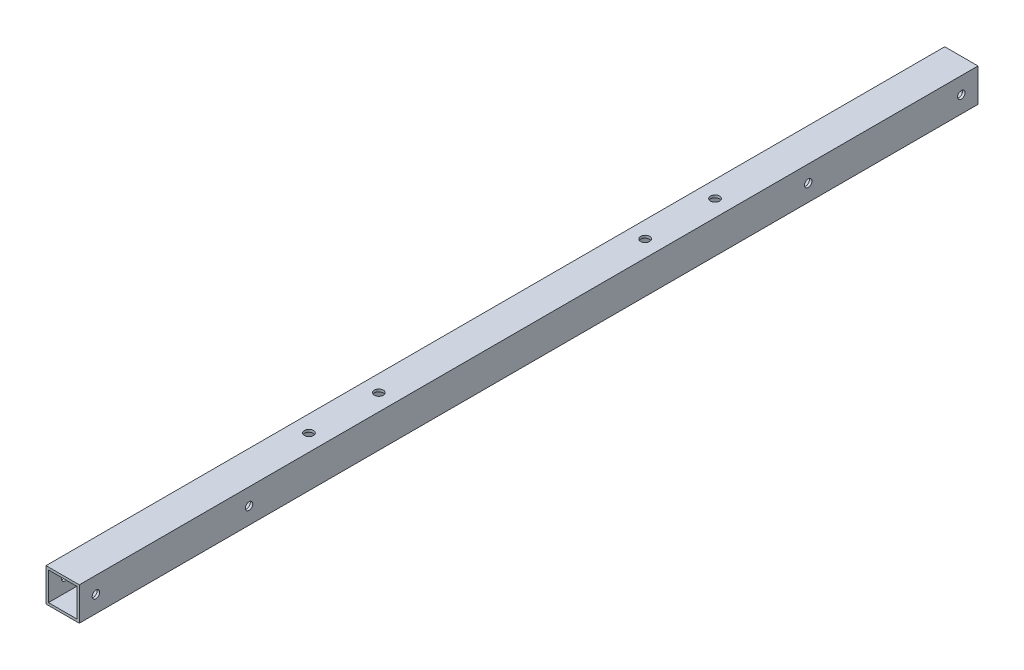
ISO-10303-21;
HEADER;
FILE_DESCRIPTION(('STEP AP214'),'2;1');
FILE_NAME('part.step','',(''),(''),'','','');
FILE_SCHEMA(('AUTOMOTIVE_DESIGN { 1 0 10303 214 1 1 1 1 }'));
ENDSEC;
DATA;
#1=APPLICATION_CONTEXT('core data for automotive mechanical design processes');
#2=APPLICATION_PROTOCOL_DEFINITION('international standard','automotive_design',2000,#1);
#3=PRODUCT_CONTEXT('',#1,'mechanical');
#4=PRODUCT('Part','Part','',(#3));
#5=PRODUCT_RELATED_PRODUCT_CATEGORY('part','',(#4));
#6=PRODUCT_DEFINITION_FORMATION('','',#4);
#7=PRODUCT_DEFINITION_CONTEXT('part definition',#1,'design');
#8=PRODUCT_DEFINITION('design','',#6,#7);
#9=PRODUCT_DEFINITION_SHAPE('','',#8);
#10=(LENGTH_UNIT() NAMED_UNIT(*) SI_UNIT(.MILLI.,.METRE.));
#11=(NAMED_UNIT(*) PLANE_ANGLE_UNIT() SI_UNIT($,.RADIAN.));
#12=(NAMED_UNIT(*) SI_UNIT($,.STERADIAN.) SOLID_ANGLE_UNIT());
#13=UNCERTAINTY_MEASURE_WITH_UNIT(LENGTH_MEASURE(1.E-05),#10,'distance_accuracy_value','');
#14=(GEOMETRIC_REPRESENTATION_CONTEXT(3) GLOBAL_UNCERTAINTY_ASSIGNED_CONTEXT((#13)) GLOBAL_UNIT_ASSIGNED_CONTEXT((#10,
#11,#12)) REPRESENTATION_CONTEXT('',''));
#15=CARTESIAN_POINT('',(0.,0.,0.));
#16=DIRECTION('',(0.,0.,1.));
#17=DIRECTION('',(1.,0.,0.));
#18=AXIS2_PLACEMENT_3D('',#15,#16,#17);
#19=CARTESIAN_POINT('',(-10.,-10.,540.));
#20=DIRECTION('',(0.,1.,0.));
#21=DIRECTION('',(0.,0.,1.));
#22=AXIS2_PLACEMENT_3D('',#19,#20,#21);
#23=PLANE('',#22);
#24=CARTESIAN_POINT('',(0.,-10.,148.));
#25=DIRECTION('',(0.,-1.,0.));
#26=DIRECTION('',(0.,0.,-1.));
#27=AXIS2_PLACEMENT_3D('',#24,#25,#26);
#28=CIRCLE('',#27,4.99999999999999);
#29=CARTESIAN_POINT('',(0.,-10.,143.));
#30=VERTEX_POINT('',#29);
#31=EDGE_CURVE('E629',#30,#30,#28,.T.);
#32=ORIENTED_EDGE('',*,*,#31,.F.);
#33=EDGE_LOOP('',(#32));
#34=FACE_BOUND('',#33,.T.);
#35=CARTESIAN_POINT('',(0.,-10.,190.));
#36=DIRECTION('',(0.,-1.,0.));
#37=DIRECTION('',(0.,0.,-1.));
#38=AXIS2_PLACEMENT_3D('',#35,#36,#37);
#39=CIRCLE('',#38,4.99999999999999);
#40=CARTESIAN_POINT('',(0.,-10.,185.));
#41=VERTEX_POINT('',#40);
#42=EDGE_CURVE('E634',#41,#41,#39,.T.);
#43=ORIENTED_EDGE('',*,*,#42,.F.);
#44=EDGE_LOOP('',(#43));
#45=FACE_BOUND('',#44,.T.);
#46=DIRECTION('',(1.,0.,0.));
#47=VECTOR('',#46,1.);
#48=CARTESIAN_POINT('',(-10.,-10.,0.));
#49=LINE('',#48,#47);
#50=CARTESIAN_POINT('',(-10.,-10.,0.));
#51=VERTEX_POINT('',#50);
#52=CARTESIAN_POINT('',(10.,-10.,0.));
#53=VERTEX_POINT('',#52);
#54=EDGE_CURVE('E167',#51,#53,#49,.T.);
#55=ORIENTED_EDGE('',*,*,#54,.T.);
#56=DIRECTION('',(0.,0.,-1.));
#57=VECTOR('',#56,1.);
#58=CARTESIAN_POINT('',(10.,-10.,540.));
#59=LINE('',#58,#57);
#60=CARTESIAN_POINT('',(10.,-10.,540.));
#61=VERTEX_POINT('',#60);
#62=EDGE_CURVE('E176',#61,#53,#59,.T.);
#63=ORIENTED_EDGE('',*,*,#62,.F.);
#64=DIRECTION('',(1.,0.,0.));
#65=VECTOR('',#64,1.);
#66=CARTESIAN_POINT('',(-10.,-10.,540.));
#67=LINE('',#66,#65);
#68=CARTESIAN_POINT('',(-10.,-10.,540.));
#69=VERTEX_POINT('',#68);
#70=EDGE_CURVE('E173',#69,#61,#67,.T.);
#71=ORIENTED_EDGE('',*,*,#70,.F.);
#72=DIRECTION('',(0.,0.,-1.));
#73=VECTOR('',#72,1.);
#74=CARTESIAN_POINT('',(-10.,-10.,540.));
#75=LINE('',#74,#73);
#76=EDGE_CURVE('E191',#69,#51,#75,.T.);
#77=ORIENTED_EDGE('',*,*,#76,.T.);
#78=EDGE_LOOP('',(#55,#63,#71,#77));
#79=FACE_BOUND('',#78,.T.);
#80=CARTESIAN_POINT('',(0.,-10.,392.));
#81=DIRECTION('',(0.,-1.,0.));
#82=DIRECTION('',(0.,0.,-1.));
#83=AXIS2_PLACEMENT_3D('',#80,#81,#82);
#84=CIRCLE('',#83,4.99999999999999);
#85=CARTESIAN_POINT('',(0.,-10.,387.));
#86=VERTEX_POINT('',#85);
#87=EDGE_CURVE('E263',#86,#86,#84,.T.);
#88=ORIENTED_EDGE('',*,*,#87,.F.);
#89=EDGE_LOOP('',(#88));
#90=FACE_BOUND('',#89,.T.);
#91=CARTESIAN_POINT('',(0.,-10.,350.));
#92=DIRECTION('',(0.,-1.,0.));
#93=DIRECTION('',(0.,0.,-1.));
#94=AXIS2_PLACEMENT_3D('',#91,#92,#93);
#95=CIRCLE('',#94,4.99999999999999);
#96=CARTESIAN_POINT('',(0.,-10.,345.));
#97=VERTEX_POINT('',#96);
#98=EDGE_CURVE('E644',#97,#97,#95,.T.);
#99=ORIENTED_EDGE('',*,*,#98,.F.);
#100=EDGE_LOOP('',(#99));
#101=FACE_BOUND('',#100,.T.);
#102=ADVANCED_FACE('F42',(#34,#45,#79,#90,#101),#23,.F.);
#103=CARTESIAN_POINT('',(-8.5,-8.5,540.));
#104=DIRECTION('',(0.,1.,0.));
#105=DIRECTION('',(0.,0.,1.));
#106=AXIS2_PLACEMENT_3D('',#103,#104,#105);
#107=PLANE('',#106);
#108=CARTESIAN_POINT('',(0.,-8.5,148.));
#109=DIRECTION('',(0.,-1.,0.));
#110=DIRECTION('',(0.,0.,-1.));
#111=AXIS2_PLACEMENT_3D('',#108,#109,#110);
#112=CIRCLE('',#111,4.99999999999999);
#113=CARTESIAN_POINT('',(0.,-8.5,143.));
#114=VERTEX_POINT('',#113);
#115=EDGE_CURVE('E627',#114,#114,#112,.T.);
#116=ORIENTED_EDGE('',*,*,#115,.T.);
#117=EDGE_LOOP('',(#116));
#118=FACE_BOUND('',#117,.T.);
#119=CARTESIAN_POINT('',(0.,-8.5,190.));
#120=DIRECTION('',(0.,-1.,0.));
#121=DIRECTION('',(0.,0.,-1.));
#122=AXIS2_PLACEMENT_3D('',#119,#120,#121);
#123=CIRCLE('',#122,4.99999999999999);
#124=CARTESIAN_POINT('',(0.,-8.5,185.));
#125=VERTEX_POINT('',#124);
#126=EDGE_CURVE('E640',#125,#125,#123,.T.);
#127=ORIENTED_EDGE('',*,*,#126,.T.);
#128=EDGE_LOOP('',(#127));
#129=FACE_BOUND('',#128,.T.);
#130=CARTESIAN_POINT('',(0.,-8.5,350.));
#131=DIRECTION('',(0.,-1.,0.));
#132=DIRECTION('',(0.,0.,-1.));
#133=AXIS2_PLACEMENT_3D('',#130,#131,#132);
#134=CIRCLE('',#133,4.99999999999999);
#135=CARTESIAN_POINT('',(0.,-8.5,345.));
#136=VERTEX_POINT('',#135);
#137=EDGE_CURVE('E272',#136,#136,#134,.T.);
#138=ORIENTED_EDGE('',*,*,#137,.T.);
#139=EDGE_LOOP('',(#138));
#140=FACE_BOUND('',#139,.T.);
#141=DIRECTION('',(1.,0.,0.));
#142=VECTOR('',#141,1.);
#143=CARTESIAN_POINT('',(-8.5,-8.5,0.));
#144=LINE('',#143,#142);
#145=CARTESIAN_POINT('',(-8.5,-8.5,0.));
#146=VERTEX_POINT('',#145);
#147=CARTESIAN_POINT('',(8.5,-8.5,0.));
#148=VERTEX_POINT('',#147);
#149=EDGE_CURVE('E120',#146,#148,#144,.T.);
#150=ORIENTED_EDGE('',*,*,#149,.F.);
#151=DIRECTION('',(0.,0.,-1.));
#152=VECTOR('',#151,1.);
#153=CARTESIAN_POINT('',(-8.5,-8.5,540.));
#154=LINE('',#153,#152);
#155=CARTESIAN_POINT('',(-8.5,-8.5,540.));
#156=VERTEX_POINT('',#155);
#157=EDGE_CURVE('E60',#156,#146,#154,.T.);
#158=ORIENTED_EDGE('',*,*,#157,.F.);
#159=DIRECTION('',(1.,0.,0.));
#160=VECTOR('',#159,1.);
#161=CARTESIAN_POINT('',(-8.5,-8.5,540.));
#162=LINE('',#161,#160);
#163=CARTESIAN_POINT('',(8.5,-8.5,540.));
#164=VERTEX_POINT('',#163);
#165=EDGE_CURVE('E138',#156,#164,#162,.T.);
#166=ORIENTED_EDGE('',*,*,#165,.T.);
#167=DIRECTION('',(0.,0.,-1.));
#168=VECTOR('',#167,1.);
#169=CARTESIAN_POINT('',(8.5,-8.5,540.));
#170=LINE('',#169,#168);
#171=EDGE_CURVE('E114',#164,#148,#170,.T.);
#172=ORIENTED_EDGE('',*,*,#171,.T.);
#173=EDGE_LOOP('',(#150,#158,#166,#172));
#174=FACE_BOUND('',#173,.T.);
#175=CARTESIAN_POINT('',(0.,-8.5,392.));
#176=DIRECTION('',(0.,-1.,0.));
#177=DIRECTION('',(0.,0.,-1.));
#178=AXIS2_PLACEMENT_3D('',#175,#176,#177);
#179=CIRCLE('',#178,4.99999999999999);
#180=CARTESIAN_POINT('',(0.,-8.5,387.));
#181=VERTEX_POINT('',#180);
#182=EDGE_CURVE('E259',#181,#181,#179,.T.);
#183=ORIENTED_EDGE('',*,*,#182,.T.);
#184=EDGE_LOOP('',(#183));
#185=FACE_BOUND('',#184,.T.);
#186=ADVANCED_FACE('F252',(#118,#129,#140,#174,#185),#107,.T.);
#187=CARTESIAN_POINT('',(0.,0.,540.));
#188=DIRECTION('',(0.,0.,-1.));
#189=DIRECTION('',(-1.,0.,0.));
#190=AXIS2_PLACEMENT_3D('',#187,#188,#189);
#191=PLANE('',#190);
#192=DIRECTION('',(0.,1.,0.));
#193=VECTOR('',#192,1.);
#194=CARTESIAN_POINT('',(10.,-10.,540.));
#195=LINE('',#194,#193);
#196=CARTESIAN_POINT('',(10.,10.,540.));
#197=VERTEX_POINT('',#196);
#198=EDGE_CURVE('E162',#61,#197,#195,.T.);
#199=ORIENTED_EDGE('',*,*,#198,.T.);
#200=DIRECTION('',(-1.,0.,0.));
#201=VECTOR('',#200,1.);
#202=CARTESIAN_POINT('',(-10.,10.,540.));
#203=LINE('',#202,#201);
#204=CARTESIAN_POINT('',(-10.,10.,540.));
#205=VERTEX_POINT('',#204);
#206=EDGE_CURVE('E166',#197,#205,#203,.T.);
#207=ORIENTED_EDGE('',*,*,#206,.T.);
#208=DIRECTION('',(0.,-1.,0.));
#209=VECTOR('',#208,1.);
#210=CARTESIAN_POINT('',(-10.,-10.,540.));
#211=LINE('',#210,#209);
#212=EDGE_CURVE('E170',#205,#69,#211,.T.);
#213=ORIENTED_EDGE('',*,*,#212,.T.);
#214=ORIENTED_EDGE('',*,*,#70,.T.);
#215=EDGE_LOOP('',(#199,#207,#213,#214));
#216=FACE_BOUND('',#215,.T.);
#217=DIRECTION('',(0.,1.,0.));
#218=VECTOR('',#217,1.);
#219=CARTESIAN_POINT('',(8.5,-8.5,540.));
#220=LINE('',#219,#218);
#221=CARTESIAN_POINT('',(8.5,8.5,540.));
#222=VERTEX_POINT('',#221);
#223=EDGE_CURVE('E110',#164,#222,#220,.T.);
#224=ORIENTED_EDGE('',*,*,#223,.F.);
#225=ORIENTED_EDGE('',*,*,#165,.F.);
#226=DIRECTION('',(0.,-1.,0.));
#227=VECTOR('',#226,1.);
#228=CARTESIAN_POINT('',(-8.5,-8.5,540.));
#229=LINE('',#228,#227);
#230=CARTESIAN_POINT('',(-8.5,8.5,540.));
#231=VERTEX_POINT('',#230);
#232=EDGE_CURVE('E133',#231,#156,#229,.T.);
#233=ORIENTED_EDGE('',*,*,#232,.F.);
#234=DIRECTION('',(-1.,0.,0.));
#235=VECTOR('',#234,1.);
#236=CARTESIAN_POINT('',(-8.5,8.5,540.));
#237=LINE('',#236,#235);
#238=EDGE_CURVE('E119',#222,#231,#237,.T.);
#239=ORIENTED_EDGE('',*,*,#238,.F.);
#240=EDGE_LOOP('',(#224,#225,#233,#239));
#241=FACE_BOUND('',#240,.T.);
#242=ADVANCED_FACE('F132',(#216,#241),#191,.F.);
#243=CARTESIAN_POINT('',(0.,0.,0.));
#244=DIRECTION('',(0.,0.,-1.));
#245=DIRECTION('',(-1.,0.,0.));
#246=AXIS2_PLACEMENT_3D('',#243,#244,#245);
#247=PLANE('',#246);
#248=DIRECTION('',(0.,1.,0.));
#249=VECTOR('',#248,1.);
#250=CARTESIAN_POINT('',(10.,-10.,0.));
#251=LINE('',#250,#249);
#252=CARTESIAN_POINT('',(10.,10.,0.));
#253=VERTEX_POINT('',#252);
#254=EDGE_CURVE('E128',#53,#253,#251,.T.);
#255=ORIENTED_EDGE('',*,*,#254,.F.);
#256=ORIENTED_EDGE('',*,*,#54,.F.);
#257=DIRECTION('',(0.,-1.,0.));
#258=VECTOR('',#257,1.);
#259=CARTESIAN_POINT('',(-10.,-10.,0.));
#260=LINE('',#259,#258);
#261=CARTESIAN_POINT('',(-10.,10.,0.));
#262=VERTEX_POINT('',#261);
#263=EDGE_CURVE('E183',#262,#51,#260,.T.);
#264=ORIENTED_EDGE('',*,*,#263,.F.);
#265=DIRECTION('',(-1.,0.,0.));
#266=VECTOR('',#265,1.);
#267=CARTESIAN_POINT('',(-10.,10.,0.));
#268=LINE('',#267,#266);
#269=EDGE_CURVE('E180',#253,#262,#268,.T.);
#270=ORIENTED_EDGE('',*,*,#269,.F.);
#271=EDGE_LOOP('',(#255,#256,#264,#270));
#272=FACE_BOUND('',#271,.T.);
#273=ORIENTED_EDGE('',*,*,#149,.T.);
#274=DIRECTION('',(0.,1.,0.));
#275=VECTOR('',#274,1.);
#276=CARTESIAN_POINT('',(8.5,-8.5,0.));
#277=LINE('',#276,#275);
#278=CARTESIAN_POINT('',(8.5,8.5,0.));
#279=VERTEX_POINT('',#278);
#280=EDGE_CURVE('E68',#148,#279,#277,.T.);
#281=ORIENTED_EDGE('',*,*,#280,.T.);
#282=DIRECTION('',(-1.,0.,0.));
#283=VECTOR('',#282,1.);
#284=CARTESIAN_POINT('',(-8.5,8.5,0.));
#285=LINE('',#284,#283);
#286=CARTESIAN_POINT('',(-8.5,8.5,0.));
#287=VERTEX_POINT('',#286);
#288=EDGE_CURVE('E126',#279,#287,#285,.T.);
#289=ORIENTED_EDGE('',*,*,#288,.T.);
#290=DIRECTION('',(0.,-1.,0.));
#291=VECTOR('',#290,1.);
#292=CARTESIAN_POINT('',(-8.5,-8.5,0.));
#293=LINE('',#292,#291);
#294=EDGE_CURVE('E149',#287,#146,#293,.T.);
#295=ORIENTED_EDGE('',*,*,#294,.T.);
#296=EDGE_LOOP('',(#273,#281,#289,#295));
#297=FACE_BOUND('',#296,.T.);
#298=ADVANCED_FACE('F251',(#272,#297),#247,.T.);
#299=CARTESIAN_POINT('',(10.,-10.,540.));
#300=DIRECTION('',(-1.,0.,0.));
#301=DIRECTION('',(0.,0.,1.));
#302=AXIS2_PLACEMENT_3D('',#299,#300,#301);
#303=PLANE('',#302);
#304=CARTESIAN_POINT('',(10.,0.,530.));
#305=DIRECTION('',(1.,0.,0.));
#306=DIRECTION('',(0.,0.,-1.));
#307=AXIS2_PLACEMENT_3D('',#304,#305,#306);
#308=CIRCLE('',#307,2.25000000000001);
#309=CARTESIAN_POINT('',(10.,0.,527.75));
#310=VERTEX_POINT('',#309);
#311=EDGE_CURVE('E307',#310,#310,#308,.T.);
#312=ORIENTED_EDGE('',*,*,#311,.F.);
#313=EDGE_LOOP('',(#312));
#314=FACE_BOUND('',#313,.T.);
#315=CARTESIAN_POINT('',(10.,0.,438.));
#316=DIRECTION('',(1.,0.,0.));
#317=DIRECTION('',(0.,0.,-1.));
#318=AXIS2_PLACEMENT_3D('',#315,#316,#317);
#319=CIRCLE('',#318,2.24999999999995);
#320=CARTESIAN_POINT('',(10.,0.,435.75));
#321=VERTEX_POINT('',#320);
#322=EDGE_CURVE('E311',#321,#321,#319,.T.);
#323=ORIENTED_EDGE('',*,*,#322,.F.);
#324=EDGE_LOOP('',(#323));
#325=FACE_BOUND('',#324,.T.);
#326=CARTESIAN_POINT('',(10.,0.,102.));
#327=DIRECTION('',(1.,0.,0.));
#328=DIRECTION('',(0.,0.,-1.));
#329=AXIS2_PLACEMENT_3D('',#326,#327,#328);
#330=CIRCLE('',#329,2.25);
#331=CARTESIAN_POINT('',(10.,0.,99.75));
#332=VERTEX_POINT('',#331);
#333=EDGE_CURVE('E319',#332,#332,#330,.T.);
#334=ORIENTED_EDGE('',*,*,#333,.F.);
#335=EDGE_LOOP('',(#334));
#336=FACE_BOUND('',#335,.T.);
#337=CARTESIAN_POINT('',(10.,0.,10.));
#338=DIRECTION('',(1.,0.,0.));
#339=DIRECTION('',(0.,0.,-1.));
#340=AXIS2_PLACEMENT_3D('',#337,#338,#339);
#341=CIRCLE('',#340,2.25);
#342=CARTESIAN_POINT('',(10.,0.,7.75000000000001));
#343=VERTEX_POINT('',#342);
#344=EDGE_CURVE('E327',#343,#343,#341,.T.);
#345=ORIENTED_EDGE('',*,*,#344,.F.);
#346=EDGE_LOOP('',(#345));
#347=FACE_BOUND('',#346,.T.);
#348=ORIENTED_EDGE('',*,*,#254,.T.);
#349=DIRECTION('',(0.,0.,-1.));
#350=VECTOR('',#349,1.);
#351=CARTESIAN_POINT('',(10.,10.,540.));
#352=LINE('',#351,#350);
#353=EDGE_CURVE('E11',#197,#253,#352,.T.);
#354=ORIENTED_EDGE('',*,*,#353,.F.);
#355=ORIENTED_EDGE('',*,*,#198,.F.);
#356=ORIENTED_EDGE('',*,*,#62,.T.);
#357=EDGE_LOOP('',(#348,#354,#355,#356));
#358=FACE_BOUND('',#357,.T.);
#359=ADVANCED_FACE('F44',(#314,#325,#336,#347,#358),#303,.F.);
#360=CARTESIAN_POINT('',(-10.,10.,540.));
#361=DIRECTION('',(0.,-1.,0.));
#362=DIRECTION('',(0.,0.,-1.));
#363=AXIS2_PLACEMENT_3D('',#360,#361,#362);
#364=PLANE('',#363);
#365=CARTESIAN_POINT('',(0.,10.,148.));
#366=DIRECTION('',(0.,1.,0.));
#367=DIRECTION('',(0.,0.,1.));
#368=AXIS2_PLACEMENT_3D('',#365,#366,#367);
#369=CIRCLE('',#368,2.7);
#370=CARTESIAN_POINT('',(0.,10.,150.7));
#371=VERTEX_POINT('',#370);
#372=EDGE_CURVE('E262',#371,#371,#369,.T.);
#373=ORIENTED_EDGE('',*,*,#372,.F.);
#374=EDGE_LOOP('',(#373));
#375=FACE_BOUND('',#374,.T.);
#376=CARTESIAN_POINT('',(0.,10.,190.));
#377=DIRECTION('',(0.,1.,0.));
#378=DIRECTION('',(0.,0.,1.));
#379=AXIS2_PLACEMENT_3D('',#376,#377,#378);
#380=CIRCLE('',#379,2.7);
#381=CARTESIAN_POINT('',(0.,10.,192.7));
#382=VERTEX_POINT('',#381);
#383=EDGE_CURVE('E279',#382,#382,#380,.T.);
#384=ORIENTED_EDGE('',*,*,#383,.F.);
#385=EDGE_LOOP('',(#384));
#386=FACE_BOUND('',#385,.T.);
#387=CARTESIAN_POINT('',(0.,10.,350.));
#388=DIRECTION('',(0.,1.,0.));
#389=DIRECTION('',(0.,0.,1.));
#390=AXIS2_PLACEMENT_3D('',#387,#388,#389);
#391=CIRCLE('',#390,2.7);
#392=CARTESIAN_POINT('',(0.,10.,352.7));
#393=VERTEX_POINT('',#392);
#394=EDGE_CURVE('E287',#393,#393,#391,.T.);
#395=ORIENTED_EDGE('',*,*,#394,.F.);
#396=EDGE_LOOP('',(#395));
#397=FACE_BOUND('',#396,.T.);
#398=CARTESIAN_POINT('',(0.,10.,392.));
#399=DIRECTION('',(0.,1.,0.));
#400=DIRECTION('',(0.,0.,1.));
#401=AXIS2_PLACEMENT_3D('',#398,#399,#400);
#402=CIRCLE('',#401,2.7);
#403=CARTESIAN_POINT('',(0.,10.,394.7));
#404=VERTEX_POINT('',#403);
#405=EDGE_CURVE('E295',#404,#404,#402,.T.);
#406=ORIENTED_EDGE('',*,*,#405,.F.);
#407=EDGE_LOOP('',(#406));
#408=FACE_BOUND('',#407,.T.);
#409=ORIENTED_EDGE('',*,*,#269,.T.);
#410=DIRECTION('',(0.,0.,-1.));
#411=VECTOR('',#410,1.);
#412=CARTESIAN_POINT('',(-10.,10.,540.));
#413=LINE('',#412,#411);
#414=EDGE_CURVE('E52',#205,#262,#413,.T.);
#415=ORIENTED_EDGE('',*,*,#414,.F.);
#416=ORIENTED_EDGE('',*,*,#206,.F.);
#417=ORIENTED_EDGE('',*,*,#353,.T.);
#418=EDGE_LOOP('',(#409,#415,#416,#417));
#419=FACE_BOUND('',#418,.T.);
#420=ADVANCED_FACE('F364',(#375,#386,#397,#408,#419),#364,.F.);
#421=CARTESIAN_POINT('',(-10.,-10.,540.));
#422=DIRECTION('',(1.,0.,0.));
#423=DIRECTION('',(0.,0.,-1.));
#424=AXIS2_PLACEMENT_3D('',#421,#422,#423);
#425=PLANE('',#424);
#426=CARTESIAN_POINT('',(-10.,0.,530.));
#427=DIRECTION('',(1.,0.,0.));
#428=DIRECTION('',(0.,0.,-1.));
#429=AXIS2_PLACEMENT_3D('',#426,#427,#428);
#430=CIRCLE('',#429,2.25000000000001);
#431=CARTESIAN_POINT('',(-10.,0.,527.75));
#432=VERTEX_POINT('',#431);
#433=EDGE_CURVE('E203',#432,#432,#430,.T.);
#434=ORIENTED_EDGE('',*,*,#433,.T.);
#435=EDGE_LOOP('',(#434));
#436=FACE_BOUND('',#435,.T.);
#437=CARTESIAN_POINT('',(-10.,0.,438.));
#438=DIRECTION('',(1.,0.,0.));
#439=DIRECTION('',(0.,0.,-1.));
#440=AXIS2_PLACEMENT_3D('',#437,#438,#439);
#441=CIRCLE('',#440,2.24999999999995);
#442=CARTESIAN_POINT('',(-10.,0.,435.75));
#443=VERTEX_POINT('',#442);
#444=EDGE_CURVE('E315',#443,#443,#441,.T.);
#445=ORIENTED_EDGE('',*,*,#444,.T.);
#446=EDGE_LOOP('',(#445));
#447=FACE_BOUND('',#446,.T.);
#448=CARTESIAN_POINT('',(-10.,0.,102.));
#449=DIRECTION('',(1.,0.,0.));
#450=DIRECTION('',(0.,0.,-1.));
#451=AXIS2_PLACEMENT_3D('',#448,#449,#450);
#452=CIRCLE('',#451,2.25);
#453=CARTESIAN_POINT('',(-10.,0.,99.75));
#454=VERTEX_POINT('',#453);
#455=EDGE_CURVE('E323',#454,#454,#452,.T.);
#456=ORIENTED_EDGE('',*,*,#455,.T.);
#457=EDGE_LOOP('',(#456));
#458=FACE_BOUND('',#457,.T.);
#459=CARTESIAN_POINT('',(-10.,0.,10.));
#460=DIRECTION('',(1.,0.,0.));
#461=DIRECTION('',(0.,0.,-1.));
#462=AXIS2_PLACEMENT_3D('',#459,#460,#461);
#463=CIRCLE('',#462,2.25);
#464=CARTESIAN_POINT('',(-10.,0.,7.75000000000001));
#465=VERTEX_POINT('',#464);
#466=EDGE_CURVE('E303',#465,#465,#463,.T.);
#467=ORIENTED_EDGE('',*,*,#466,.T.);
#468=EDGE_LOOP('',(#467));
#469=FACE_BOUND('',#468,.T.);
#470=ORIENTED_EDGE('',*,*,#263,.T.);
#471=ORIENTED_EDGE('',*,*,#76,.F.);
#472=ORIENTED_EDGE('',*,*,#212,.F.);
#473=ORIENTED_EDGE('',*,*,#414,.T.);
#474=EDGE_LOOP('',(#470,#471,#472,#473));
#475=FACE_BOUND('',#474,.T.);
#476=ADVANCED_FACE('F335',(#436,#447,#458,#469,#475),#425,.F.);
#477=CARTESIAN_POINT('',(8.5,-8.5,540.));
#478=DIRECTION('',(-1.,0.,0.));
#479=DIRECTION('',(0.,0.,1.));
#480=AXIS2_PLACEMENT_3D('',#477,#478,#479);
#481=PLANE('',#480);
#482=CARTESIAN_POINT('',(8.5,0.,530.));
#483=DIRECTION('',(-1.,0.,0.));
#484=DIRECTION('',(0.,0.,1.));
#485=AXIS2_PLACEMENT_3D('',#482,#483,#484);
#486=CIRCLE('',#485,2.25000000000001);
#487=CARTESIAN_POINT('',(8.5,0.,532.25));
#488=VERTEX_POINT('',#487);
#489=EDGE_CURVE('E146',#488,#488,#486,.T.);
#490=ORIENTED_EDGE('',*,*,#489,.F.);
#491=EDGE_LOOP('',(#490));
#492=FACE_BOUND('',#491,.T.);
#493=CARTESIAN_POINT('',(8.5,0.,438.));
#494=DIRECTION('',(-1.,0.,0.));
#495=DIRECTION('',(0.,0.,1.));
#496=AXIS2_PLACEMENT_3D('',#493,#494,#495);
#497=CIRCLE('',#496,2.24999999999995);
#498=CARTESIAN_POINT('',(8.5,0.,440.25));
#499=VERTEX_POINT('',#498);
#500=EDGE_CURVE('E211',#499,#499,#497,.T.);
#501=ORIENTED_EDGE('',*,*,#500,.F.);
#502=EDGE_LOOP('',(#501));
#503=FACE_BOUND('',#502,.T.);
#504=CARTESIAN_POINT('',(8.5,0.,102.));
#505=DIRECTION('',(-1.,0.,0.));
#506=DIRECTION('',(0.,0.,1.));
#507=AXIS2_PLACEMENT_3D('',#504,#505,#506);
#508=CIRCLE('',#507,2.25);
#509=CARTESIAN_POINT('',(8.5,0.,104.25));
#510=VERTEX_POINT('',#509);
#511=EDGE_CURVE('E207',#510,#510,#508,.T.);
#512=ORIENTED_EDGE('',*,*,#511,.F.);
#513=EDGE_LOOP('',(#512));
#514=FACE_BOUND('',#513,.T.);
#515=CARTESIAN_POINT('',(8.5,0.,10.));
#516=DIRECTION('',(-1.,0.,0.));
#517=DIRECTION('',(0.,0.,1.));
#518=AXIS2_PLACEMENT_3D('',#515,#516,#517);
#519=CIRCLE('',#518,2.25);
#520=CARTESIAN_POINT('',(8.5,0.,12.25));
#521=VERTEX_POINT('',#520);
#522=EDGE_CURVE('E202',#521,#521,#519,.T.);
#523=ORIENTED_EDGE('',*,*,#522,.F.);
#524=EDGE_LOOP('',(#523));
#525=FACE_BOUND('',#524,.T.);
#526=ORIENTED_EDGE('',*,*,#280,.F.);
#527=ORIENTED_EDGE('',*,*,#171,.F.);
#528=ORIENTED_EDGE('',*,*,#223,.T.);
#529=DIRECTION('',(0.,0.,-1.));
#530=VECTOR('',#529,1.);
#531=CARTESIAN_POINT('',(8.5,8.5,540.));
#532=LINE('',#531,#530);
#533=EDGE_CURVE('E113',#222,#279,#532,.T.);
#534=ORIENTED_EDGE('',*,*,#533,.T.);
#535=EDGE_LOOP('',(#526,#527,#528,#534));
#536=FACE_BOUND('',#535,.T.);
#537=ADVANCED_FACE('F112',(#492,#503,#514,#525,#536),#481,.T.);
#538=CARTESIAN_POINT('',(-8.5,8.5,540.));
#539=DIRECTION('',(0.,-1.,0.));
#540=DIRECTION('',(0.,0.,-1.));
#541=AXIS2_PLACEMENT_3D('',#538,#539,#540);
#542=PLANE('',#541);
#543=CARTESIAN_POINT('',(0.,8.5,148.));
#544=DIRECTION('',(0.,-1.,0.));
#545=DIRECTION('',(0.,0.,-1.));
#546=AXIS2_PLACEMENT_3D('',#543,#544,#545);
#547=CIRCLE('',#546,2.7);
#548=CARTESIAN_POINT('',(0.,8.5,145.3));
#549=VERTEX_POINT('',#548);
#550=EDGE_CURVE('E269',#549,#549,#547,.T.);
#551=ORIENTED_EDGE('',*,*,#550,.F.);
#552=EDGE_LOOP('',(#551));
#553=FACE_BOUND('',#552,.T.);
#554=CARTESIAN_POINT('',(0.,8.5,190.));
#555=DIRECTION('',(0.,-1.,0.));
#556=DIRECTION('',(0.,0.,-1.));
#557=AXIS2_PLACEMENT_3D('',#554,#555,#556);
#558=CIRCLE('',#557,2.7);
#559=CARTESIAN_POINT('',(0.,8.5,187.3));
#560=VERTEX_POINT('',#559);
#561=EDGE_CURVE('E283',#560,#560,#558,.T.);
#562=ORIENTED_EDGE('',*,*,#561,.F.);
#563=EDGE_LOOP('',(#562));
#564=FACE_BOUND('',#563,.T.);
#565=CARTESIAN_POINT('',(0.,8.5,350.));
#566=DIRECTION('',(0.,-1.,0.));
#567=DIRECTION('',(0.,0.,-1.));
#568=AXIS2_PLACEMENT_3D('',#565,#566,#567);
#569=CIRCLE('',#568,2.7);
#570=CARTESIAN_POINT('',(0.,8.5,347.3));
#571=VERTEX_POINT('',#570);
#572=EDGE_CURVE('E291',#571,#571,#569,.T.);
#573=ORIENTED_EDGE('',*,*,#572,.F.);
#574=EDGE_LOOP('',(#573));
#575=FACE_BOUND('',#574,.T.);
#576=CARTESIAN_POINT('',(0.,8.5,392.));
#577=DIRECTION('',(0.,-1.,0.));
#578=DIRECTION('',(0.,0.,-1.));
#579=AXIS2_PLACEMENT_3D('',#576,#577,#578);
#580=CIRCLE('',#579,2.7);
#581=CARTESIAN_POINT('',(0.,8.5,389.3));
#582=VERTEX_POINT('',#581);
#583=EDGE_CURVE('E299',#582,#582,#580,.T.);
#584=ORIENTED_EDGE('',*,*,#583,.F.);
#585=EDGE_LOOP('',(#584));
#586=FACE_BOUND('',#585,.T.);
#587=ORIENTED_EDGE('',*,*,#288,.F.);
#588=ORIENTED_EDGE('',*,*,#533,.F.);
#589=ORIENTED_EDGE('',*,*,#238,.T.);
#590=DIRECTION('',(0.,0.,-1.));
#591=VECTOR('',#590,1.);
#592=CARTESIAN_POINT('',(-8.5,8.5,540.));
#593=LINE('',#592,#591);
#594=EDGE_CURVE('E129',#231,#287,#593,.T.);
#595=ORIENTED_EDGE('',*,*,#594,.T.);
#596=EDGE_LOOP('',(#587,#588,#589,#595));
#597=FACE_BOUND('',#596,.T.);
#598=ADVANCED_FACE('F123',(#553,#564,#575,#586,#597),#542,.T.);
#599=CARTESIAN_POINT('',(-8.5,-8.5,540.));
#600=DIRECTION('',(1.,0.,0.));
#601=DIRECTION('',(0.,0.,-1.));
#602=AXIS2_PLACEMENT_3D('',#599,#600,#601);
#603=PLANE('',#602);
#604=CARTESIAN_POINT('',(-8.5,0.,530.));
#605=DIRECTION('',(1.,0.,0.));
#606=DIRECTION('',(0.,0.,-1.));
#607=AXIS2_PLACEMENT_3D('',#604,#605,#606);
#608=CIRCLE('',#607,2.25000000000001);
#609=CARTESIAN_POINT('',(-8.5,0.,527.75));
#610=VERTEX_POINT('',#609);
#611=EDGE_CURVE('E46',#610,#610,#608,.T.);
#612=ORIENTED_EDGE('',*,*,#611,.F.);
#613=EDGE_LOOP('',(#612));
#614=FACE_BOUND('',#613,.T.);
#615=CARTESIAN_POINT('',(-8.5,0.,438.));
#616=DIRECTION('',(1.,0.,0.));
#617=DIRECTION('',(0.,0.,-1.));
#618=AXIS2_PLACEMENT_3D('',#615,#616,#617);
#619=CIRCLE('',#618,2.24999999999995);
#620=CARTESIAN_POINT('',(-8.5,0.,435.75));
#621=VERTEX_POINT('',#620);
#622=EDGE_CURVE('E208',#621,#621,#619,.T.);
#623=ORIENTED_EDGE('',*,*,#622,.F.);
#624=EDGE_LOOP('',(#623));
#625=FACE_BOUND('',#624,.T.);
#626=CARTESIAN_POINT('',(-8.5,0.,102.));
#627=DIRECTION('',(1.,0.,0.));
#628=DIRECTION('',(0.,0.,-1.));
#629=AXIS2_PLACEMENT_3D('',#626,#627,#628);
#630=CIRCLE('',#629,2.25);
#631=CARTESIAN_POINT('',(-8.5,0.,99.75));
#632=VERTEX_POINT('',#631);
#633=EDGE_CURVE('E204',#632,#632,#630,.T.);
#634=ORIENTED_EDGE('',*,*,#633,.F.);
#635=EDGE_LOOP('',(#634));
#636=FACE_BOUND('',#635,.T.);
#637=CARTESIAN_POINT('',(-8.5,0.,10.));
#638=DIRECTION('',(1.,0.,0.));
#639=DIRECTION('',(0.,0.,-1.));
#640=AXIS2_PLACEMENT_3D('',#637,#638,#639);
#641=CIRCLE('',#640,2.25);
#642=CARTESIAN_POINT('',(-8.5,0.,7.75000000000001));
#643=VERTEX_POINT('',#642);
#644=EDGE_CURVE('E198',#643,#643,#641,.T.);
#645=ORIENTED_EDGE('',*,*,#644,.F.);
#646=EDGE_LOOP('',(#645));
#647=FACE_BOUND('',#646,.T.);
#648=ORIENTED_EDGE('',*,*,#294,.F.);
#649=ORIENTED_EDGE('',*,*,#594,.F.);
#650=ORIENTED_EDGE('',*,*,#232,.T.);
#651=ORIENTED_EDGE('',*,*,#157,.T.);
#652=EDGE_LOOP('',(#648,#649,#650,#651));
#653=FACE_BOUND('',#652,.T.);
#654=ADVANCED_FACE('F239',(#614,#625,#636,#647,#653),#603,.T.);
#655=CARTESIAN_POINT('',(-10.,0.,10.));
#656=DIRECTION('',(1.,0.,0.));
#657=DIRECTION('',(0.,0.,-1.));
#658=AXIS2_PLACEMENT_3D('',#655,#656,#657);
#659=CYLINDRICAL_SURFACE('',#658,2.25);
#660=ORIENTED_EDGE('',*,*,#644,.T.);
#661=EDGE_LOOP('',(#660));
#662=FACE_BOUND('',#661,.T.);
#663=ORIENTED_EDGE('',*,*,#466,.F.);
#664=EDGE_LOOP('',(#663));
#665=FACE_BOUND('',#664,.T.);
#666=ADVANCED_FACE('F242',(#662,#665),#659,.F.);
#667=CARTESIAN_POINT('',(-10.,0.,102.));
#668=DIRECTION('',(1.,0.,0.));
#669=DIRECTION('',(0.,0.,-1.));
#670=AXIS2_PLACEMENT_3D('',#667,#668,#669);
#671=CYLINDRICAL_SURFACE('',#670,2.25);
#672=ORIENTED_EDGE('',*,*,#633,.T.);
#673=EDGE_LOOP('',(#672));
#674=FACE_BOUND('',#673,.T.);
#675=ORIENTED_EDGE('',*,*,#455,.F.);
#676=EDGE_LOOP('',(#675));
#677=FACE_BOUND('',#676,.T.);
#678=ADVANCED_FACE('F339',(#674,#677),#671,.F.);
#679=CARTESIAN_POINT('',(-10.,0.,438.));
#680=DIRECTION('',(1.,0.,0.));
#681=DIRECTION('',(0.,0.,-1.));
#682=AXIS2_PLACEMENT_3D('',#679,#680,#681);
#683=CYLINDRICAL_SURFACE('',#682,2.24999999999995);
#684=ORIENTED_EDGE('',*,*,#622,.T.);
#685=EDGE_LOOP('',(#684));
#686=FACE_BOUND('',#685,.T.);
#687=ORIENTED_EDGE('',*,*,#444,.F.);
#688=EDGE_LOOP('',(#687));
#689=FACE_BOUND('',#688,.T.);
#690=ADVANCED_FACE('F346',(#686,#689),#683,.F.);
#691=CARTESIAN_POINT('',(-10.,0.,530.));
#692=DIRECTION('',(1.,0.,0.));
#693=DIRECTION('',(0.,0.,-1.));
#694=AXIS2_PLACEMENT_3D('',#691,#692,#693);
#695=CYLINDRICAL_SURFACE('',#694,2.25000000000001);
#696=ORIENTED_EDGE('',*,*,#611,.T.);
#697=EDGE_LOOP('',(#696));
#698=FACE_BOUND('',#697,.T.);
#699=ORIENTED_EDGE('',*,*,#433,.F.);
#700=EDGE_LOOP('',(#699));
#701=FACE_BOUND('',#700,.T.);
#702=ADVANCED_FACE('F236',(#698,#701),#695,.F.);
#703=ORIENTED_EDGE('',*,*,#522,.T.);
#704=EDGE_LOOP('',(#703));
#705=FACE_BOUND('',#704,.T.);
#706=ORIENTED_EDGE('',*,*,#344,.T.);
#707=EDGE_LOOP('',(#706));
#708=FACE_BOUND('',#707,.T.);
#709=ADVANCED_FACE('F342',(#705,#708),#659,.F.);
#710=ORIENTED_EDGE('',*,*,#511,.T.);
#711=EDGE_LOOP('',(#710));
#712=FACE_BOUND('',#711,.T.);
#713=ORIENTED_EDGE('',*,*,#333,.T.);
#714=EDGE_LOOP('',(#713));
#715=FACE_BOUND('',#714,.T.);
#716=ADVANCED_FACE('F349',(#712,#715),#671,.F.);
#717=ORIENTED_EDGE('',*,*,#500,.T.);
#718=EDGE_LOOP('',(#717));
#719=FACE_BOUND('',#718,.T.);
#720=ORIENTED_EDGE('',*,*,#322,.T.);
#721=EDGE_LOOP('',(#720));
#722=FACE_BOUND('',#721,.T.);
#723=ADVANCED_FACE('F428',(#719,#722),#683,.F.);
#724=ORIENTED_EDGE('',*,*,#489,.T.);
#725=EDGE_LOOP('',(#724));
#726=FACE_BOUND('',#725,.T.);
#727=ORIENTED_EDGE('',*,*,#311,.T.);
#728=EDGE_LOOP('',(#727));
#729=FACE_BOUND('',#728,.T.);
#730=ADVANCED_FACE('F420',(#726,#729),#695,.F.);
#731=CARTESIAN_POINT('',(0.,10.,392.));
#732=DIRECTION('',(0.,1.,0.));
#733=DIRECTION('',(0.,0.,1.));
#734=AXIS2_PLACEMENT_3D('',#731,#732,#733);
#735=CYLINDRICAL_SURFACE('',#734,2.7);
#736=ORIENTED_EDGE('',*,*,#583,.T.);
#737=EDGE_LOOP('',(#736));
#738=FACE_BOUND('',#737,.T.);
#739=ORIENTED_EDGE('',*,*,#405,.T.);
#740=EDGE_LOOP('',(#739));
#741=FACE_BOUND('',#740,.T.);
#742=ADVANCED_FACE('F417',(#738,#741),#735,.F.);
#743=CARTESIAN_POINT('',(0.,10.,350.));
#744=DIRECTION('',(0.,1.,0.));
#745=DIRECTION('',(0.,0.,1.));
#746=AXIS2_PLACEMENT_3D('',#743,#744,#745);
#747=CYLINDRICAL_SURFACE('',#746,2.7);
#748=ORIENTED_EDGE('',*,*,#572,.T.);
#749=EDGE_LOOP('',(#748));
#750=FACE_BOUND('',#749,.T.);
#751=ORIENTED_EDGE('',*,*,#394,.T.);
#752=EDGE_LOOP('',(#751));
#753=FACE_BOUND('',#752,.T.);
#754=ADVANCED_FACE('F419',(#750,#753),#747,.F.);
#755=CARTESIAN_POINT('',(0.,10.,190.));
#756=DIRECTION('',(0.,1.,0.));
#757=DIRECTION('',(0.,0.,1.));
#758=AXIS2_PLACEMENT_3D('',#755,#756,#757);
#759=CYLINDRICAL_SURFACE('',#758,2.7);
#760=ORIENTED_EDGE('',*,*,#561,.T.);
#761=EDGE_LOOP('',(#760));
#762=FACE_BOUND('',#761,.T.);
#763=ORIENTED_EDGE('',*,*,#383,.T.);
#764=EDGE_LOOP('',(#763));
#765=FACE_BOUND('',#764,.T.);
#766=ADVANCED_FACE('F425',(#762,#765),#759,.F.);
#767=CARTESIAN_POINT('',(0.,10.,148.));
#768=DIRECTION('',(0.,1.,0.));
#769=DIRECTION('',(0.,0.,1.));
#770=AXIS2_PLACEMENT_3D('',#767,#768,#769);
#771=CYLINDRICAL_SURFACE('',#770,2.7);
#772=ORIENTED_EDGE('',*,*,#550,.T.);
#773=EDGE_LOOP('',(#772));
#774=FACE_BOUND('',#773,.T.);
#775=ORIENTED_EDGE('',*,*,#372,.T.);
#776=EDGE_LOOP('',(#775));
#777=FACE_BOUND('',#776,.T.);
#778=ADVANCED_FACE('F565',(#774,#777),#771,.F.);
#779=CARTESIAN_POINT('',(0.,-10.,392.));
#780=DIRECTION('',(0.,-1.,0.));
#781=DIRECTION('',(0.,0.,-1.));
#782=AXIS2_PLACEMENT_3D('',#779,#780,#781);
#783=CYLINDRICAL_SURFACE('',#782,4.99999999999999);
#784=ORIENTED_EDGE('',*,*,#182,.F.);
#785=EDGE_LOOP('',(#784));
#786=FACE_BOUND('',#785,.T.);
#787=ORIENTED_EDGE('',*,*,#87,.T.);
#788=EDGE_LOOP('',(#787));
#789=FACE_BOUND('',#788,.T.);
#790=ADVANCED_FACE('F572',(#786,#789),#783,.F.);
#791=CARTESIAN_POINT('',(0.,-10.,350.));
#792=DIRECTION('',(0.,-1.,0.));
#793=DIRECTION('',(0.,0.,-1.));
#794=AXIS2_PLACEMENT_3D('',#791,#792,#793);
#795=CYLINDRICAL_SURFACE('',#794,4.99999999999999);
#796=ORIENTED_EDGE('',*,*,#137,.F.);
#797=EDGE_LOOP('',(#796));
#798=FACE_BOUND('',#797,.T.);
#799=ORIENTED_EDGE('',*,*,#98,.T.);
#800=EDGE_LOOP('',(#799));
#801=FACE_BOUND('',#800,.T.);
#802=ADVANCED_FACE('F591',(#798,#801),#795,.F.);
#803=CARTESIAN_POINT('',(0.,-10.,190.));
#804=DIRECTION('',(0.,-1.,0.));
#805=DIRECTION('',(0.,0.,-1.));
#806=AXIS2_PLACEMENT_3D('',#803,#804,#805);
#807=CYLINDRICAL_SURFACE('',#806,4.99999999999999);
#808=ORIENTED_EDGE('',*,*,#126,.F.);
#809=EDGE_LOOP('',(#808));
#810=FACE_BOUND('',#809,.T.);
#811=ORIENTED_EDGE('',*,*,#42,.T.);
#812=EDGE_LOOP('',(#811));
#813=FACE_BOUND('',#812,.T.);
#814=ADVANCED_FACE('F599',(#810,#813),#807,.F.);
#815=CARTESIAN_POINT('',(0.,-10.,148.));
#816=DIRECTION('',(0.,-1.,0.));
#817=DIRECTION('',(0.,0.,-1.));
#818=AXIS2_PLACEMENT_3D('',#815,#816,#817);
#819=CYLINDRICAL_SURFACE('',#818,4.99999999999999);
#820=ORIENTED_EDGE('',*,*,#115,.F.);
#821=EDGE_LOOP('',(#820));
#822=FACE_BOUND('',#821,.T.);
#823=ORIENTED_EDGE('',*,*,#31,.T.);
#824=EDGE_LOOP('',(#823));
#825=FACE_BOUND('',#824,.T.);
#826=ADVANCED_FACE('F608',(#822,#825),#819,.F.);
#827=CLOSED_SHELL('',(#102,#186,#242,#298,#359,#420,#476,#537,#598,#654,#666,#678,#690,#702,
#709,#716,#723,#730,#742,#754,#766,#778,#790,#802,#814,#826));
#828=MANIFOLD_SOLID_BREP('B2',#827);
#829=ADVANCED_BREP_SHAPE_REPRESENTATION('',(#18,#828),#14);
#830=SHAPE_DEFINITION_REPRESENTATION(#9,#829);
ENDSEC;
END-ISO-10303-21;
